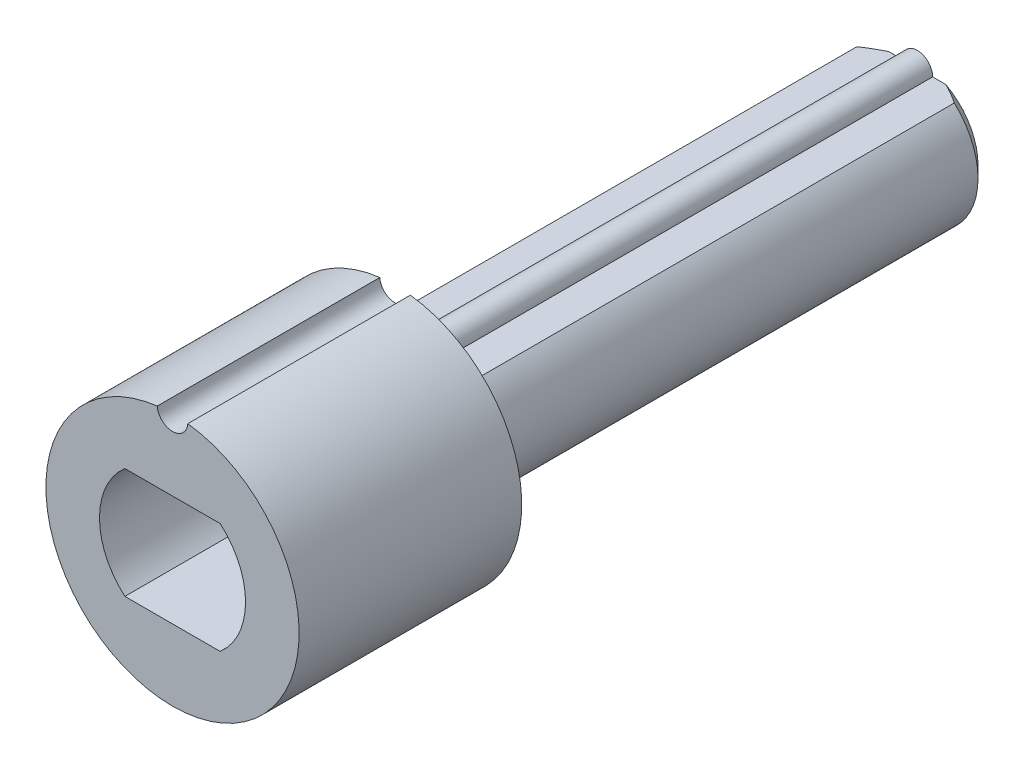
ISO-10303-21;
HEADER;
FILE_DESCRIPTION(('STEP AP214'),'2;1');
FILE_NAME('part.step','',(''),(''),'','','');
FILE_SCHEMA(('AUTOMOTIVE_DESIGN { 1 0 10303 214 1 1 1 1 }'));
ENDSEC;
DATA;
#1=APPLICATION_CONTEXT('core data for automotive mechanical design processes');
#2=APPLICATION_PROTOCOL_DEFINITION('international standard','automotive_design',2000,#1);
#3=PRODUCT_CONTEXT('',#1,'mechanical');
#4=PRODUCT('Part','Part','',(#3));
#5=PRODUCT_RELATED_PRODUCT_CATEGORY('part','',(#4));
#6=PRODUCT_DEFINITION_FORMATION('','',#4);
#7=PRODUCT_DEFINITION_CONTEXT('part definition',#1,'design');
#8=PRODUCT_DEFINITION('design','',#6,#7);
#9=PRODUCT_DEFINITION_SHAPE('','',#8);
#10=(LENGTH_UNIT() NAMED_UNIT(*) SI_UNIT(.MILLI.,.METRE.));
#11=(NAMED_UNIT(*) PLANE_ANGLE_UNIT() SI_UNIT($,.RADIAN.));
#12=(NAMED_UNIT(*) SI_UNIT($,.STERADIAN.) SOLID_ANGLE_UNIT());
#13=UNCERTAINTY_MEASURE_WITH_UNIT(LENGTH_MEASURE(1.E-05),#10,'distance_accuracy_value','');
#14=(GEOMETRIC_REPRESENTATION_CONTEXT(3) GLOBAL_UNCERTAINTY_ASSIGNED_CONTEXT((#13)) GLOBAL_UNIT_ASSIGNED_CONTEXT((#10,
#11,#12)) REPRESENTATION_CONTEXT('',''));
#15=CARTESIAN_POINT('',(0.,0.,0.));
#16=DIRECTION('',(0.,0.,1.));
#17=DIRECTION('',(1.,0.,0.));
#18=AXIS2_PLACEMENT_3D('',#15,#16,#17);
#19=CARTESIAN_POINT('',(0.,2.275,22.17));
#20=DIRECTION('',(0.,0.,-1.));
#21=DIRECTION('',(-1.,0.,0.));
#22=AXIS2_PLACEMENT_3D('',#19,#20,#21);
#23=CYLINDRICAL_SURFACE('',#22,0.65);
#24=CARTESIAN_POINT('',(0.,2.275,0.));
#25=DIRECTION('',(0.,0.,1.));
#26=DIRECTION('',(1.,0.,0.));
#27=AXIS2_PLACEMENT_3D('',#24,#25,#26);
#28=CIRCLE('',#27,0.65);
#29=CARTESIAN_POINT('',(0.65,2.275,0.));
#30=VERTEX_POINT('',#29);
#31=CARTESIAN_POINT('',(-0.65,2.275,0.));
#32=VERTEX_POINT('',#31);
#33=EDGE_CURVE('E199',#30,#32,#28,.T.);
#34=ORIENTED_EDGE('',*,*,#33,.T.);
#35=DIRECTION('',(0.,0.,-1.));
#36=VECTOR('',#35,1.);
#37=CARTESIAN_POINT('',(-0.65,2.275,22.17));
#38=LINE('',#37,#36);
#39=CARTESIAN_POINT('',(-0.65,2.275,22.17));
#40=VERTEX_POINT('',#39);
#41=EDGE_CURVE('E241',#40,#32,#38,.T.);
#42=ORIENTED_EDGE('',*,*,#41,.F.);
#43=CARTESIAN_POINT('',(0.,2.275,22.17));
#44=DIRECTION('',(0.,0.,1.));
#45=DIRECTION('',(1.,0.,0.));
#46=AXIS2_PLACEMENT_3D('',#43,#44,#45);
#47=CIRCLE('',#46,0.65);
#48=CARTESIAN_POINT('',(0.65,2.275,22.17));
#49=VERTEX_POINT('',#48);
#50=EDGE_CURVE('E200',#49,#40,#47,.T.);
#51=ORIENTED_EDGE('',*,*,#50,.F.);
#52=DIRECTION('',(0.,0.,-1.));
#53=VECTOR('',#52,1.);
#54=CARTESIAN_POINT('',(0.65,2.275,22.17));
#55=LINE('',#54,#53);
#56=EDGE_CURVE('E219',#49,#30,#55,.T.);
#57=ORIENTED_EDGE('',*,*,#56,.T.);
#58=EDGE_LOOP('',(#34,#42,#51,#57));
#59=FACE_BOUND('',#58,.T.);
#60=ADVANCED_FACE('F35',(#59),#23,.T.);
#61=CARTESIAN_POINT('',(-2.06881608655772,2.275,22.17));
#62=DIRECTION('',(0.,-1.,0.));
#63=DIRECTION('',(1.,0.,0.));
#64=AXIS2_PLACEMENT_3D('',#61,#62,#63);
#65=PLANE('',#64);
#66=DIRECTION('',(-1.,0.,0.));
#67=VECTOR('',#66,1.);
#68=CARTESIAN_POINT('',(-2.06881608655772,2.275,0.));
#69=LINE('',#68,#67);
#70=CARTESIAN_POINT('',(-1.20623380818149,2.275,0.));
#71=VERTEX_POINT('',#70);
#72=EDGE_CURVE('E222',#32,#71,#69,.T.);
#73=ORIENTED_EDGE('',*,*,#72,.T.);
#74=CARTESIAN_POINT('',(-1.20623380818149,2.275,0.));
#75=CARTESIAN_POINT('',(-1.28162576248777,2.275,0.0353468415406038));
#76=CARTESIAN_POINT('',(-1.35601278341627,2.275,0.0727469613475034));
#77=CARTESIAN_POINT('',(-1.50288654900661,2.275,0.150874304019356));
#78=CARTESIAN_POINT('',(-1.57537589567412,2.275,0.191596617824444));
#79=CARTESIAN_POINT('',(-1.7187528316815,2.275,0.275678884445083));
#80=CARTESIAN_POINT('',(-1.78964105093513,2.275,0.319037774289895));
#81=CARTESIAN_POINT('',(-1.93015336834408,2.275,0.407982780985104));
#82=CARTESIAN_POINT('',(-1.99977548544706,2.275,0.453572034771658));
#83=CARTESIAN_POINT('',(-2.06881608655772,2.275,0.499999999999994));
#84=B_SPLINE_CURVE_WITH_KNOTS('',3,(#74,#75,#76,#77,#78,#79,#80,#81,#82,#83),.UNSPECIFIED.,.F.,
.F.,(4,2,2,2,4),(0.,0.249714039328846,0.499065547991467,0.748317185356793,0.997930073809381),.UNSPECIFIED.);
#85=CARTESIAN_POINT('',(-2.06881608655772,2.275,0.499999999999993));
#86=VERTEX_POINT('',#85);
#87=EDGE_CURVE('E11',#71,#86,#84,.T.);
#88=ORIENTED_EDGE('',*,*,#87,.T.);
#89=DIRECTION('',(0.,0.,-1.));
#90=VECTOR('',#89,1.);
#91=CARTESIAN_POINT('',(-2.06881608655772,2.275,22.17));
#92=LINE('',#91,#90);
#93=CARTESIAN_POINT('',(-2.06881608655772,2.275,22.17));
#94=VERTEX_POINT('',#93);
#95=EDGE_CURVE('E239',#94,#86,#92,.T.);
#96=ORIENTED_EDGE('',*,*,#95,.F.);
#97=DIRECTION('',(-1.,0.,0.));
#98=VECTOR('',#97,1.);
#99=CARTESIAN_POINT('',(-2.06881608655772,2.275,22.17));
#100=LINE('',#99,#98);
#101=EDGE_CURVE('E203',#40,#94,#100,.T.);
#102=ORIENTED_EDGE('',*,*,#101,.F.);
#103=ORIENTED_EDGE('',*,*,#41,.T.);
#104=EDGE_LOOP('',(#73,#88,#96,#102,#103));
#105=FACE_BOUND('',#104,.T.);
#106=ADVANCED_FACE('F294',(#105),#65,.F.);
#107=CARTESIAN_POINT('',(0.,0.,22.17));
#108=DIRECTION('',(0.,0.,-1.));
#109=DIRECTION('',(-1.,0.,0.));
#110=AXIS2_PLACEMENT_3D('',#107,#108,#109);
#111=CYLINDRICAL_SURFACE('',#110,3.075);
#112=ORIENTED_EDGE('',*,*,#95,.T.);
#113=CARTESIAN_POINT('',(0.,0.,0.499999999999994));
#114=DIRECTION('',(0.,0.,1.));
#115=DIRECTION('',(1.,0.,0.));
#116=AXIS2_PLACEMENT_3D('',#113,#114,#115);
#117=CIRCLE('',#116,3.075);
#118=CARTESIAN_POINT('',(-2.06881608655772,-2.275,0.499999999999994));
#119=VERTEX_POINT('',#118);
#120=EDGE_CURVE('E48',#86,#119,#117,.T.);
#121=ORIENTED_EDGE('',*,*,#120,.T.);
#122=DIRECTION('',(0.,0.,-1.));
#123=VECTOR('',#122,1.);
#124=CARTESIAN_POINT('',(-2.06881608655772,-2.275,22.17));
#125=LINE('',#124,#123);
#126=CARTESIAN_POINT('',(-2.06881608655772,-2.275,22.17));
#127=VERTEX_POINT('',#126);
#128=EDGE_CURVE('E236',#127,#119,#125,.T.);
#129=ORIENTED_EDGE('',*,*,#128,.F.);
#130=CARTESIAN_POINT('',(0.,0.,22.17));
#131=DIRECTION('',(0.,0.,1.));
#132=DIRECTION('',(1.,0.,0.));
#133=AXIS2_PLACEMENT_3D('',#130,#131,#132);
#134=CIRCLE('',#133,3.075);
#135=EDGE_CURVE('E207',#94,#127,#134,.T.);
#136=ORIENTED_EDGE('',*,*,#135,.F.);
#137=EDGE_LOOP('',(#112,#121,#129,#136));
#138=FACE_BOUND('',#137,.T.);
#139=ADVANCED_FACE('F274',(#138),#111,.T.);
#140=CARTESIAN_POINT('',(-2.06881608655772,-2.275,22.17));
#141=DIRECTION('',(0.,1.,0.));
#142=DIRECTION('',(-1.,0.,0.));
#143=AXIS2_PLACEMENT_3D('',#140,#141,#142);
#144=PLANE('',#143);
#145=DIRECTION('',(1.,0.,0.));
#146=VECTOR('',#145,1.);
#147=CARTESIAN_POINT('',(-2.06881608655772,-2.275,0.));
#148=LINE('',#147,#146);
#149=CARTESIAN_POINT('',(-1.20623380818149,-2.275,0.));
#150=VERTEX_POINT('',#149);
#151=CARTESIAN_POINT('',(1.20623380818149,-2.275,0.));
#152=VERTEX_POINT('',#151);
#153=EDGE_CURVE('E224',#150,#152,#148,.T.);
#154=ORIENTED_EDGE('',*,*,#153,.T.);
#155=CARTESIAN_POINT('',(1.20623380818149,-2.275,0.));
#156=CARTESIAN_POINT('',(1.28162576248777,-2.275,0.0353468415406041));
#157=CARTESIAN_POINT('',(1.35601278341626,-2.275,0.0727469613475036));
#158=CARTESIAN_POINT('',(1.50288654900661,-2.275,0.150874304019356));
#159=CARTESIAN_POINT('',(1.57537589567412,-2.275,0.191596617824443));
#160=CARTESIAN_POINT('',(1.7187528316815,-2.275,0.275678884445082));
#161=CARTESIAN_POINT('',(1.78964105093512,-2.275,0.319037774289894));
#162=CARTESIAN_POINT('',(1.93015336834407,-2.275,0.407982780985104));
#163=CARTESIAN_POINT('',(1.99977548544706,-2.275,0.453572034771658));
#164=CARTESIAN_POINT('',(2.06881608655772,-2.275,0.499999999999993));
#165=B_SPLINE_CURVE_WITH_KNOTS('',3,(#155,#156,#157,#158,#159,#160,#161,#162,#163,#164),
.UNSPECIFIED.,.F.,.F.,(4,2,2,2,4),(0.,0.249714039328845,0.499065547991466,0.748317185356793,
0.99793007380938),.UNSPECIFIED.);
#166=CARTESIAN_POINT('',(2.06881608655772,-2.275,0.499999999999993));
#167=VERTEX_POINT('',#166);
#168=EDGE_CURVE('E282',#152,#167,#165,.T.);
#169=ORIENTED_EDGE('',*,*,#168,.T.);
#170=DIRECTION('',(0.,0.,-1.));
#171=VECTOR('',#170,1.);
#172=CARTESIAN_POINT('',(2.06881608655772,-2.275,22.17));
#173=LINE('',#172,#171);
#174=CARTESIAN_POINT('',(2.06881608655772,-2.275,22.17));
#175=VERTEX_POINT('',#174);
#176=EDGE_CURVE('E233',#175,#167,#173,.T.);
#177=ORIENTED_EDGE('',*,*,#176,.F.);
#178=DIRECTION('',(1.,0.,0.));
#179=VECTOR('',#178,1.);
#180=CARTESIAN_POINT('',(-2.06881608655772,-2.275,22.17));
#181=LINE('',#180,#179);
#182=EDGE_CURVE('E210',#127,#175,#181,.T.);
#183=ORIENTED_EDGE('',*,*,#182,.F.);
#184=ORIENTED_EDGE('',*,*,#128,.T.);
#185=CARTESIAN_POINT('',(-2.06881608655772,-2.275,0.499999999999994));
#186=CARTESIAN_POINT('',(-1.99977548544706,-2.275,0.453572034771659));
#187=CARTESIAN_POINT('',(-1.93015336834407,-2.275,0.407982780985105));
#188=CARTESIAN_POINT('',(-1.78964105093512,-2.275,0.319037774289895));
#189=CARTESIAN_POINT('',(-1.7187528316815,-2.275,0.275678884445083));
#190=CARTESIAN_POINT('',(-1.57537589567412,-2.275,0.191596617824444));
#191=CARTESIAN_POINT('',(-1.50288654900661,-2.275,0.150874304019356));
#192=CARTESIAN_POINT('',(-1.35601278341626,-2.275,0.0727469613475034));
#193=CARTESIAN_POINT('',(-1.28162576248777,-2.275,0.0353468415406039));
#194=CARTESIAN_POINT('',(-1.20623380818149,-2.275,0.));
#195=B_SPLINE_CURVE_WITH_KNOTS('',3,(#185,#186,#187,#188,#189,#190,#191,#192,#193,#194),
.UNSPECIFIED.,.F.,.F.,(4,2,2,2,4),(0.,0.249612888452588,0.498864525817915,0.748216034480536,
0.997930073809382),.UNSPECIFIED.);
#196=EDGE_CURVE('E61',#119,#150,#195,.T.);
#197=ORIENTED_EDGE('',*,*,#196,.T.);
#198=EDGE_LOOP('',(#154,#169,#177,#183,#184,#197));
#199=FACE_BOUND('',#198,.T.);
#200=ADVANCED_FACE('F269',(#199),#144,.F.);
#201=CARTESIAN_POINT('',(0.,0.,22.17));
#202=DIRECTION('',(0.,0.,-1.));
#203=DIRECTION('',(-1.,0.,0.));
#204=AXIS2_PLACEMENT_3D('',#201,#202,#203);
#205=CYLINDRICAL_SURFACE('',#204,3.075);
#206=ORIENTED_EDGE('',*,*,#176,.T.);
#207=CARTESIAN_POINT('',(0.,0.,0.499999999999994));
#208=DIRECTION('',(0.,0.,1.));
#209=DIRECTION('',(1.,0.,0.));
#210=AXIS2_PLACEMENT_3D('',#207,#208,#209);
#211=CIRCLE('',#210,3.075);
#212=CARTESIAN_POINT('',(2.06881608655772,2.275,0.499999999999994));
#213=VERTEX_POINT('',#212);
#214=EDGE_CURVE('E244',#167,#213,#211,.T.);
#215=ORIENTED_EDGE('',*,*,#214,.T.);
#216=DIRECTION('',(0.,0.,-1.));
#217=VECTOR('',#216,1.);
#218=CARTESIAN_POINT('',(2.06881608655772,2.275,22.17));
#219=LINE('',#218,#217);
#220=CARTESIAN_POINT('',(2.06881608655772,2.275,22.17));
#221=VERTEX_POINT('',#220);
#222=EDGE_CURVE('E230',#221,#213,#219,.T.);
#223=ORIENTED_EDGE('',*,*,#222,.F.);
#224=CARTESIAN_POINT('',(0.,0.,22.17));
#225=DIRECTION('',(0.,0.,1.));
#226=DIRECTION('',(1.,0.,0.));
#227=AXIS2_PLACEMENT_3D('',#224,#225,#226);
#228=CIRCLE('',#227,3.075);
#229=EDGE_CURVE('E213',#175,#221,#228,.T.);
#230=ORIENTED_EDGE('',*,*,#229,.F.);
#231=EDGE_LOOP('',(#206,#215,#223,#230));
#232=FACE_BOUND('',#231,.T.);
#233=ADVANCED_FACE('F264',(#232),#205,.T.);
#234=CARTESIAN_POINT('',(0.65,2.275,22.17));
#235=DIRECTION('',(0.,-1.,0.));
#236=DIRECTION('',(1.,0.,0.));
#237=AXIS2_PLACEMENT_3D('',#234,#235,#236);
#238=PLANE('',#237);
#239=ORIENTED_EDGE('',*,*,#222,.T.);
#240=CARTESIAN_POINT('',(2.06881608655772,2.275,0.499999999999994));
#241=CARTESIAN_POINT('',(1.99977548544706,2.275,0.453572034771658));
#242=CARTESIAN_POINT('',(1.93015336834408,2.275,0.407982780985104));
#243=CARTESIAN_POINT('',(1.78964105093513,2.275,0.319037774289894));
#244=CARTESIAN_POINT('',(1.7187528316815,2.275,0.275678884445083));
#245=CARTESIAN_POINT('',(1.57537589567412,2.275,0.191596617824444));
#246=CARTESIAN_POINT('',(1.50288654900661,2.275,0.150874304019356));
#247=CARTESIAN_POINT('',(1.35601278341627,2.275,0.0727469613475032));
#248=CARTESIAN_POINT('',(1.28162576248777,2.275,0.0353468415406036));
#249=CARTESIAN_POINT('',(1.20623380818149,2.275,0.));
#250=B_SPLINE_CURVE_WITH_KNOTS('',3,(#240,#241,#242,#243,#244,#245,#246,#247,#248,#249),
.UNSPECIFIED.,.F.,.F.,(4,2,2,2,4),(0.,0.249612888452587,0.498864525817914,0.748216034480535,
0.997930073809381),.UNSPECIFIED.);
#251=CARTESIAN_POINT('',(1.20623380818149,2.275,0.));
#252=VERTEX_POINT('',#251);
#253=EDGE_CURVE('E247',#213,#252,#250,.T.);
#254=ORIENTED_EDGE('',*,*,#253,.T.);
#255=DIRECTION('',(-1.,0.,0.));
#256=VECTOR('',#255,1.);
#257=CARTESIAN_POINT('',(0.65,2.275,0.));
#258=LINE('',#257,#256);
#259=EDGE_CURVE('E204',#252,#30,#258,.T.);
#260=ORIENTED_EDGE('',*,*,#259,.T.);
#261=ORIENTED_EDGE('',*,*,#56,.F.);
#262=DIRECTION('',(-1.,0.,0.));
#263=VECTOR('',#262,1.);
#264=CARTESIAN_POINT('',(0.65,2.275,22.17));
#265=LINE('',#264,#263);
#266=EDGE_CURVE('E216',#221,#49,#265,.T.);
#267=ORIENTED_EDGE('',*,*,#266,.F.);
#268=EDGE_LOOP('',(#239,#254,#260,#261,#267));
#269=FACE_BOUND('',#268,.T.);
#270=ADVANCED_FACE('F258',(#269),#238,.F.);
#271=CARTESIAN_POINT('',(0.,2.275,0.));
#272=DIRECTION('',(0.,0.,1.));
#273=DIRECTION('',(1.,0.,0.));
#274=AXIS2_PLACEMENT_3D('',#271,#272,#273);
#275=PLANE('',#274);
#276=ORIENTED_EDGE('',*,*,#259,.F.);
#277=CARTESIAN_POINT('',(0.,0.,0.));
#278=DIRECTION('',(0.,0.,1.));
#279=DIRECTION('',(1.,0.,0.));
#280=AXIS2_PLACEMENT_3D('',#277,#278,#279);
#281=CIRCLE('',#280,2.575);
#282=EDGE_CURVE('E301',#252,#152,#281,.F.);
#283=ORIENTED_EDGE('',*,*,#282,.T.);
#284=ORIENTED_EDGE('',*,*,#153,.F.);
#285=CARTESIAN_POINT('',(0.,0.,0.));
#286=DIRECTION('',(0.,0.,1.));
#287=DIRECTION('',(1.,0.,0.));
#288=AXIS2_PLACEMENT_3D('',#285,#286,#287);
#289=CIRCLE('',#288,2.575);
#290=EDGE_CURVE('E253',#150,#71,#289,.F.);
#291=ORIENTED_EDGE('',*,*,#290,.T.);
#292=ORIENTED_EDGE('',*,*,#72,.F.);
#293=ORIENTED_EDGE('',*,*,#33,.F.);
#294=EDGE_LOOP('',(#276,#283,#284,#291,#292,#293));
#295=FACE_BOUND('',#294,.T.);
#296=ADVANCED_FACE('F263',(#295),#275,.F.);
#297=CARTESIAN_POINT('',(0.,2.6875,22.17));
#298=DIRECTION('',(0.,0.,1.));
#299=DIRECTION('',(1.,0.,0.));
#300=AXIS2_PLACEMENT_3D('',#297,#298,#299);
#301=PLANE('',#300);
#302=CARTESIAN_POINT('',(0.,5.375,22.17));
#303=DIRECTION('',(0.,0.,-1.));
#304=DIRECTION('',(1.,0.,0.));
#305=AXIS2_PLACEMENT_3D('',#302,#303,#304);
#306=CIRCLE('',#305,0.649999999999996);
#307=CARTESIAN_POINT('',(0.648810702134213,5.3356976744186,22.17));
#308=VERTEX_POINT('',#307);
#309=CARTESIAN_POINT('',(-0.648810702134212,5.3356976744186,22.17));
#310=VERTEX_POINT('',#309);
#311=EDGE_CURVE('E180',#308,#310,#306,.T.);
#312=ORIENTED_EDGE('',*,*,#311,.F.);
#313=CARTESIAN_POINT('',(0.,0.,22.17));
#314=DIRECTION('',(0.,0.,1.));
#315=DIRECTION('',(1.,0.,0.));
#316=AXIS2_PLACEMENT_3D('',#313,#314,#315);
#317=CIRCLE('',#316,5.375);
#318=EDGE_CURVE('E188',#310,#308,#317,.T.);
#319=ORIENTED_EDGE('',*,*,#318,.F.);
#320=EDGE_LOOP('',(#312,#319));
#321=FACE_BOUND('',#320,.T.);
#322=ORIENTED_EDGE('',*,*,#266,.T.);
#323=ORIENTED_EDGE('',*,*,#50,.T.);
#324=ORIENTED_EDGE('',*,*,#101,.T.);
#325=ORIENTED_EDGE('',*,*,#135,.T.);
#326=ORIENTED_EDGE('',*,*,#182,.T.);
#327=ORIENTED_EDGE('',*,*,#229,.T.);
#328=EDGE_LOOP('',(#322,#323,#324,#325,#326,#327));
#329=FACE_BOUND('',#328,.T.);
#330=ADVANCED_FACE('F292',(#321,#329),#301,.F.);
#331=CARTESIAN_POINT('',(0.,5.375,31.62));
#332=DIRECTION('',(0.,0.,-1.));
#333=DIRECTION('',(-1.,0.,0.));
#334=AXIS2_PLACEMENT_3D('',#331,#332,#333);
#335=CYLINDRICAL_SURFACE('',#334,0.649999999999996);
#336=ORIENTED_EDGE('',*,*,#311,.T.);
#337=DIRECTION('',(0.,0.,-1.));
#338=VECTOR('',#337,1.);
#339=CARTESIAN_POINT('',(-0.648810702134212,5.3356976744186,31.62));
#340=LINE('',#339,#338);
#341=CARTESIAN_POINT('',(-0.648810702134212,5.3356976744186,31.62));
#342=VERTEX_POINT('',#341);
#343=EDGE_CURVE('E196',#342,#310,#340,.T.);
#344=ORIENTED_EDGE('',*,*,#343,.F.);
#345=CARTESIAN_POINT('',(0.,5.375,31.62));
#346=DIRECTION('',(0.,0.,-1.));
#347=DIRECTION('',(1.,0.,0.));
#348=AXIS2_PLACEMENT_3D('',#345,#346,#347);
#349=CIRCLE('',#348,0.649999999999996);
#350=CARTESIAN_POINT('',(0.648810702134213,5.3356976744186,31.62));
#351=VERTEX_POINT('',#350);
#352=EDGE_CURVE('E184',#351,#342,#349,.T.);
#353=ORIENTED_EDGE('',*,*,#352,.F.);
#354=DIRECTION('',(0.,0.,-1.));
#355=VECTOR('',#354,1.);
#356=CARTESIAN_POINT('',(0.648810702134213,5.3356976744186,31.62));
#357=LINE('',#356,#355);
#358=EDGE_CURVE('E190',#351,#308,#357,.T.);
#359=ORIENTED_EDGE('',*,*,#358,.T.);
#360=EDGE_LOOP('',(#336,#344,#353,#359));
#361=FACE_BOUND('',#360,.T.);
#362=ADVANCED_FACE('F345',(#361),#335,.F.);
#363=CARTESIAN_POINT('',(0.,0.,31.62));
#364=DIRECTION('',(0.,0.,-1.));
#365=DIRECTION('',(-1.,0.,0.));
#366=AXIS2_PLACEMENT_3D('',#363,#364,#365);
#367=CYLINDRICAL_SURFACE('',#366,5.375);
#368=ORIENTED_EDGE('',*,*,#318,.T.);
#369=ORIENTED_EDGE('',*,*,#358,.F.);
#370=CARTESIAN_POINT('',(0.,0.,31.62));
#371=DIRECTION('',(0.,0.,1.));
#372=DIRECTION('',(1.,0.,0.));
#373=AXIS2_PLACEMENT_3D('',#370,#371,#372);
#374=CIRCLE('',#373,5.375);
#375=EDGE_CURVE('E187',#342,#351,#374,.T.);
#376=ORIENTED_EDGE('',*,*,#375,.F.);
#377=ORIENTED_EDGE('',*,*,#343,.T.);
#378=EDGE_LOOP('',(#368,#369,#376,#377));
#379=FACE_BOUND('',#378,.T.);
#380=ADVANCED_FACE('F353',(#379),#367,.T.);
#381=CARTESIAN_POINT('',(0.,2.6875,31.62));
#382=DIRECTION('',(0.,0.,1.));
#383=DIRECTION('',(1.,0.,0.));
#384=AXIS2_PLACEMENT_3D('',#381,#382,#383);
#385=PLANE('',#384);
#386=CARTESIAN_POINT('',(0.,0.,31.62));
#387=DIRECTION('',(0.,0.,1.));
#388=DIRECTION('',(1.,0.,0.));
#389=AXIS2_PLACEMENT_3D('',#386,#387,#388);
#390=CIRCLE('',#389,3.1);
#391=CARTESIAN_POINT('',(2.02175666191557,-2.35,31.62));
#392=VERTEX_POINT('',#391);
#393=CARTESIAN_POINT('',(2.02175666191557,2.35,31.62));
#394=VERTEX_POINT('',#393);
#395=EDGE_CURVE('E148',#392,#394,#390,.T.);
#396=ORIENTED_EDGE('',*,*,#395,.F.);
#397=DIRECTION('',(1.,0.,0.));
#398=VECTOR('',#397,1.);
#399=CARTESIAN_POINT('',(-2.02175666191557,-2.35,31.62));
#400=LINE('',#399,#398);
#401=CARTESIAN_POINT('',(-2.02175666191557,-2.35,31.62));
#402=VERTEX_POINT('',#401);
#403=EDGE_CURVE('E165',#402,#392,#400,.T.);
#404=ORIENTED_EDGE('',*,*,#403,.F.);
#405=CARTESIAN_POINT('',(0.,0.,31.62));
#406=DIRECTION('',(0.,0.,1.));
#407=DIRECTION('',(1.,0.,0.));
#408=AXIS2_PLACEMENT_3D('',#405,#406,#407);
#409=CIRCLE('',#408,3.1);
#410=CARTESIAN_POINT('',(-2.02175666191557,2.35,31.62));
#411=VERTEX_POINT('',#410);
#412=EDGE_CURVE('E168',#411,#402,#409,.T.);
#413=ORIENTED_EDGE('',*,*,#412,.F.);
#414=DIRECTION('',(-1.,0.,0.));
#415=VECTOR('',#414,1.);
#416=CARTESIAN_POINT('',(-2.02175666191557,2.35,31.62));
#417=LINE('',#416,#415);
#418=EDGE_CURVE('E174',#394,#411,#417,.T.);
#419=ORIENTED_EDGE('',*,*,#418,.F.);
#420=EDGE_LOOP('',(#396,#404,#413,#419));
#421=FACE_BOUND('',#420,.T.);
#422=ORIENTED_EDGE('',*,*,#352,.T.);
#423=ORIENTED_EDGE('',*,*,#375,.T.);
#424=EDGE_LOOP('',(#422,#423));
#425=FACE_BOUND('',#424,.T.);
#426=ADVANCED_FACE('F360',(#421,#425),#385,.T.);
#427=CARTESIAN_POINT('',(0.,0.,24.82));
#428=DIRECTION('',(0.,0.,1.));
#429=DIRECTION('',(1.,0.,0.));
#430=AXIS2_PLACEMENT_3D('',#427,#428,#429);
#431=CYLINDRICAL_SURFACE('',#430,3.1);
#432=ORIENTED_EDGE('',*,*,#395,.T.);
#433=DIRECTION('',(0.,0.,1.));
#434=VECTOR('',#433,1.);
#435=CARTESIAN_POINT('',(2.02175666191557,2.35,24.82));
#436=LINE('',#435,#434);
#437=CARTESIAN_POINT('',(2.02175666191557,2.35,24.82));
#438=VERTEX_POINT('',#437);
#439=EDGE_CURVE('E141',#438,#394,#436,.T.);
#440=ORIENTED_EDGE('',*,*,#439,.F.);
#441=CARTESIAN_POINT('',(0.,0.,24.82));
#442=DIRECTION('',(0.,0.,1.));
#443=DIRECTION('',(1.,0.,0.));
#444=AXIS2_PLACEMENT_3D('',#441,#442,#443);
#445=CIRCLE('',#444,3.1);
#446=CARTESIAN_POINT('',(2.02175666191557,-2.35,24.82));
#447=VERTEX_POINT('',#446);
#448=EDGE_CURVE('E145',#447,#438,#445,.T.);
#449=ORIENTED_EDGE('',*,*,#448,.F.);
#450=DIRECTION('',(0.,0.,1.));
#451=VECTOR('',#450,1.);
#452=CARTESIAN_POINT('',(2.02175666191557,-2.35,24.82));
#453=LINE('',#452,#451);
#454=EDGE_CURVE('E178',#447,#392,#453,.T.);
#455=ORIENTED_EDGE('',*,*,#454,.T.);
#456=EDGE_LOOP('',(#432,#440,#449,#455));
#457=FACE_BOUND('',#456,.T.);
#458=ADVANCED_FACE('F143',(#457),#431,.F.);
#459=CARTESIAN_POINT('',(-2.02175666191557,-2.35,24.82));
#460=DIRECTION('',(0.,-1.,0.));
#461=DIRECTION('',(0.,0.,-1.));
#462=AXIS2_PLACEMENT_3D('',#459,#460,#461);
#463=PLANE('',#462);
#464=ORIENTED_EDGE('',*,*,#403,.T.);
#465=ORIENTED_EDGE('',*,*,#454,.F.);
#466=DIRECTION('',(1.,0.,0.));
#467=VECTOR('',#466,1.);
#468=CARTESIAN_POINT('',(-2.02175666191557,-2.35,24.82));
#469=LINE('',#468,#467);
#470=CARTESIAN_POINT('',(-2.02175666191557,-2.35,24.82));
#471=VERTEX_POINT('',#470);
#472=EDGE_CURVE('E153',#471,#447,#469,.T.);
#473=ORIENTED_EDGE('',*,*,#472,.F.);
#474=DIRECTION('',(0.,0.,1.));
#475=VECTOR('',#474,1.);
#476=CARTESIAN_POINT('',(-2.02175666191557,-2.35,24.82));
#477=LINE('',#476,#475);
#478=EDGE_CURVE('E181',#471,#402,#477,.T.);
#479=ORIENTED_EDGE('',*,*,#478,.T.);
#480=EDGE_LOOP('',(#464,#465,#473,#479));
#481=FACE_BOUND('',#480,.T.);
#482=ADVANCED_FACE('F375',(#481),#463,.F.);
#483=CARTESIAN_POINT('',(0.,0.,24.82));
#484=DIRECTION('',(0.,0.,1.));
#485=DIRECTION('',(1.,0.,0.));
#486=AXIS2_PLACEMENT_3D('',#483,#484,#485);
#487=CYLINDRICAL_SURFACE('',#486,3.1);
#488=ORIENTED_EDGE('',*,*,#412,.T.);
#489=ORIENTED_EDGE('',*,*,#478,.F.);
#490=CARTESIAN_POINT('',(0.,0.,24.82));
#491=DIRECTION('',(0.,0.,1.));
#492=DIRECTION('',(1.,0.,0.));
#493=AXIS2_PLACEMENT_3D('',#490,#491,#492);
#494=CIRCLE('',#493,3.1);
#495=CARTESIAN_POINT('',(-2.02175666191557,2.35,24.82));
#496=VERTEX_POINT('',#495);
#497=EDGE_CURVE('E161',#496,#471,#494,.T.);
#498=ORIENTED_EDGE('',*,*,#497,.F.);
#499=DIRECTION('',(0.,0.,1.));
#500=VECTOR('',#499,1.);
#501=CARTESIAN_POINT('',(-2.02175666191557,2.35,24.82));
#502=LINE('',#501,#500);
#503=EDGE_CURVE('E152',#496,#411,#502,.T.);
#504=ORIENTED_EDGE('',*,*,#503,.T.);
#505=EDGE_LOOP('',(#488,#489,#498,#504));
#506=FACE_BOUND('',#505,.T.);
#507=ADVANCED_FACE('F382',(#506),#487,.F.);
#508=CARTESIAN_POINT('',(-2.02175666191557,2.35,24.82));
#509=DIRECTION('',(0.,1.,0.));
#510=DIRECTION('',(-1.,0.,0.));
#511=AXIS2_PLACEMENT_3D('',#508,#509,#510);
#512=PLANE('',#511);
#513=ORIENTED_EDGE('',*,*,#418,.T.);
#514=ORIENTED_EDGE('',*,*,#503,.F.);
#515=DIRECTION('',(-1.,0.,0.));
#516=VECTOR('',#515,1.);
#517=CARTESIAN_POINT('',(-2.02175666191557,2.35,24.82));
#518=LINE('',#517,#516);
#519=EDGE_CURVE('E156',#438,#496,#518,.T.);
#520=ORIENTED_EDGE('',*,*,#519,.F.);
#521=ORIENTED_EDGE('',*,*,#439,.T.);
#522=EDGE_LOOP('',(#513,#514,#520,#521));
#523=FACE_BOUND('',#522,.T.);
#524=ADVANCED_FACE('F157',(#523),#512,.F.);
#525=CARTESIAN_POINT('',(0.,0.,24.82));
#526=DIRECTION('',(0.,0.,1.));
#527=DIRECTION('',(1.,0.,0.));
#528=AXIS2_PLACEMENT_3D('',#525,#526,#527);
#529=PLANE('',#528);
#530=ORIENTED_EDGE('',*,*,#448,.T.);
#531=ORIENTED_EDGE('',*,*,#519,.T.);
#532=ORIENTED_EDGE('',*,*,#497,.T.);
#533=ORIENTED_EDGE('',*,*,#472,.T.);
#534=EDGE_LOOP('',(#530,#531,#532,#533));
#535=FACE_BOUND('',#534,.T.);
#536=ADVANCED_FACE('F163',(#535),#529,.T.);
#537=CARTESIAN_POINT('',(0.,0.,0.499999999999994));
#538=DIRECTION('',(0.,0.,1.));
#539=DIRECTION('',(1.,0.,0.));
#540=AXIS2_PLACEMENT_3D('',#537,#538,#539);
#541=CONICAL_SURFACE('',#540,3.075,0.78539816339745);
#542=ORIENTED_EDGE('',*,*,#168,.F.);
#543=ORIENTED_EDGE('',*,*,#282,.F.);
#544=ORIENTED_EDGE('',*,*,#253,.F.);
#545=ORIENTED_EDGE('',*,*,#214,.F.);
#546=EDGE_LOOP('',(#542,#543,#544,#545));
#547=FACE_BOUND('',#546,.T.);
#548=ADVANCED_FACE('F255',(#547),#541,.T.);
#549=CARTESIAN_POINT('',(0.,0.,0.499999999999994));
#550=DIRECTION('',(0.,0.,1.));
#551=DIRECTION('',(1.,0.,0.));
#552=AXIS2_PLACEMENT_3D('',#549,#550,#551);
#553=CONICAL_SURFACE('',#552,3.075,0.78539816339745);
#554=ORIENTED_EDGE('',*,*,#87,.F.);
#555=ORIENTED_EDGE('',*,*,#290,.F.);
#556=ORIENTED_EDGE('',*,*,#196,.F.);
#557=ORIENTED_EDGE('',*,*,#120,.F.);
#558=EDGE_LOOP('',(#554,#555,#556,#557));
#559=FACE_BOUND('',#558,.T.);
#560=ADVANCED_FACE('F37',(#559),#553,.T.);
#561=CLOSED_SHELL('',(#60,#106,#139,#200,#233,#270,#296,#330,#362,#380,#426,#458,#482,#507,#524,
#536,#548,#560));
#562=MANIFOLD_SOLID_BREP('B2',#561);
#563=ADVANCED_BREP_SHAPE_REPRESENTATION('',(#18,#562),#14);
#564=SHAPE_DEFINITION_REPRESENTATION(#9,#563);
ENDSEC;
END-ISO-10303-21;
